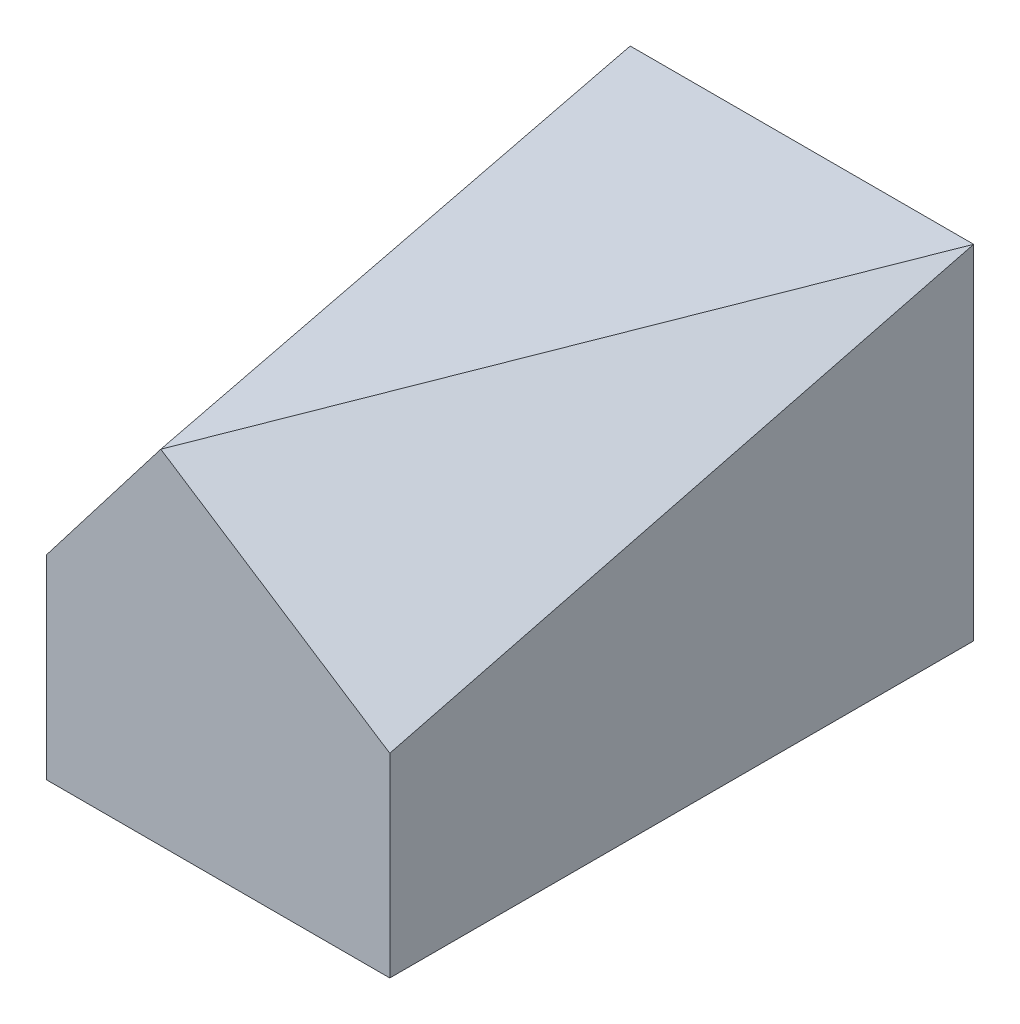
ISO-10303-21;
HEADER;
FILE_DESCRIPTION(('STEP AP214'),'2;1');
FILE_NAME('part.step','',(''),(''),'','','');
FILE_SCHEMA(('AUTOMOTIVE_DESIGN { 1 0 10303 214 1 1 1 1 }'));
ENDSEC;
DATA;
#1=APPLICATION_CONTEXT('core data for automotive mechanical design processes');
#2=APPLICATION_PROTOCOL_DEFINITION('international standard','automotive_design',2000,#1);
#3=PRODUCT_CONTEXT('',#1,'mechanical');
#4=PRODUCT('Part','Part','',(#3));
#5=PRODUCT_RELATED_PRODUCT_CATEGORY('part','',(#4));
#6=PRODUCT_DEFINITION_FORMATION('','',#4);
#7=PRODUCT_DEFINITION_CONTEXT('part definition',#1,'design');
#8=PRODUCT_DEFINITION('design','',#6,#7);
#9=PRODUCT_DEFINITION_SHAPE('','',#8);
#10=(LENGTH_UNIT() NAMED_UNIT(*) SI_UNIT(.MILLI.,.METRE.));
#11=(NAMED_UNIT(*) PLANE_ANGLE_UNIT() SI_UNIT($,.RADIAN.));
#12=(NAMED_UNIT(*) SI_UNIT($,.STERADIAN.) SOLID_ANGLE_UNIT());
#13=UNCERTAINTY_MEASURE_WITH_UNIT(LENGTH_MEASURE(1.E-05),#10,'distance_accuracy_value','');
#14=(GEOMETRIC_REPRESENTATION_CONTEXT(3) GLOBAL_UNCERTAINTY_ASSIGNED_CONTEXT((#13)) GLOBAL_UNIT_ASSIGNED_CONTEXT((#10,
#11,#12)) REPRESENTATION_CONTEXT('',''));
#15=CARTESIAN_POINT('',(0.,0.,0.));
#16=DIRECTION('',(0.,0.,1.));
#17=DIRECTION('',(1.,0.,0.));
#18=AXIS2_PLACEMENT_3D('',#15,#16,#17);
#19=CARTESIAN_POINT('',(30.,30.,0.));
#20=DIRECTION('',(0.,0.,-1.));
#21=DIRECTION('',(-1.,0.,0.));
#22=AXIS2_PLACEMENT_3D('',#19,#20,#21);
#23=PLANE('',#22);
#24=DIRECTION('',(0.838443616300637,-0.544988350595414,0.));
#25=VECTOR('',#24,1.);
#26=CARTESIAN_POINT('',(24.0597539543058,20.8611599297012,0.));
#27=LINE('',#26,#25);
#28=CARTESIAN_POINT('',(10.,30.,0.));
#29=VERTEX_POINT('',#28);
#30=CARTESIAN_POINT('',(30.,17.,0.));
#31=VERTEX_POINT('',#30);
#32=EDGE_CURVE('E100',#29,#31,#27,.T.);
#33=ORIENTED_EDGE('',*,*,#32,.F.);
#34=DIRECTION('',(-0.609710760849693,-0.7926239891046,0.));
#35=VECTOR('',#34,1.);
#36=CARTESIAN_POINT('',(17.4349442379182,39.6654275092937,0.));
#37=LINE('',#36,#35);
#38=CARTESIAN_POINT('',(0.,17.,0.));
#39=VERTEX_POINT('',#38);
#40=EDGE_CURVE('E83',#29,#39,#37,.T.);
#41=ORIENTED_EDGE('',*,*,#40,.T.);
#42=DIRECTION('',(0.,-1.,0.));
#43=VECTOR('',#42,1.);
#44=CARTESIAN_POINT('',(0.,30.,0.));
#45=LINE('',#44,#43);
#46=CARTESIAN_POINT('',(0.,0.,0.));
#47=VERTEX_POINT('',#46);
#48=EDGE_CURVE('E77',#39,#47,#45,.T.);
#49=ORIENTED_EDGE('',*,*,#48,.T.);
#50=DIRECTION('',(1.,0.,0.));
#51=VECTOR('',#50,1.);
#52=CARTESIAN_POINT('',(30.,0.,0.));
#53=LINE('',#52,#51);
#54=CARTESIAN_POINT('',(30.,0.,0.));
#55=VERTEX_POINT('',#54);
#56=EDGE_CURVE('E81',#47,#55,#53,.T.);
#57=ORIENTED_EDGE('',*,*,#56,.T.);
#58=DIRECTION('',(0.,-1.,0.));
#59=VECTOR('',#58,1.);
#60=CARTESIAN_POINT('',(30.,30.,0.));
#61=LINE('',#60,#59);
#62=EDGE_CURVE('E112',#31,#55,#61,.T.);
#63=ORIENTED_EDGE('',*,*,#62,.F.);
#64=EDGE_LOOP('',(#33,#41,#49,#57,#63));
#65=FACE_BOUND('',#64,.T.);
#66=ADVANCED_FACE('F35',(#65),#23,.F.);
#67=CARTESIAN_POINT('',(30.,30.,-51.));
#68=DIRECTION('',(-1.,0.,0.));
#69=DIRECTION('',(0.,0.,1.));
#70=AXIS2_PLACEMENT_3D('',#67,#68,#69);
#71=PLANE('',#70);
#72=DIRECTION('',(0.,0.247003705083364,-0.969014535327046));
#73=VECTOR('',#72,1.);
#74=CARTESIAN_POINT('',(30.,30.,-51.));
#75=LINE('',#74,#73);
#76=CARTESIAN_POINT('',(30.,30.,-51.));
#77=VERTEX_POINT('',#76);
#78=EDGE_CURVE('E49',#31,#77,#75,.T.);
#79=ORIENTED_EDGE('',*,*,#78,.F.);
#80=ORIENTED_EDGE('',*,*,#62,.T.);
#81=DIRECTION('',(0.,0.,-1.));
#82=VECTOR('',#81,1.);
#83=CARTESIAN_POINT('',(30.,0.,-51.));
#84=LINE('',#83,#82);
#85=CARTESIAN_POINT('',(30.,0.,-51.));
#86=VERTEX_POINT('',#85);
#87=EDGE_CURVE('E99',#55,#86,#84,.T.);
#88=ORIENTED_EDGE('',*,*,#87,.T.);
#89=DIRECTION('',(0.,-1.,0.));
#90=VECTOR('',#89,1.);
#91=CARTESIAN_POINT('',(30.,30.,-51.));
#92=LINE('',#91,#90);
#93=EDGE_CURVE('E109',#77,#86,#92,.T.);
#94=ORIENTED_EDGE('',*,*,#93,.F.);
#95=EDGE_LOOP('',(#79,#80,#88,#94));
#96=FACE_BOUND('',#95,.T.);
#97=ADVANCED_FACE('F120',(#96),#71,.F.);
#98=CARTESIAN_POINT('',(0.,30.,0.));
#99=DIRECTION('',(0.,-1.,0.));
#100=DIRECTION('',(0.,0.,-1.));
#101=AXIS2_PLACEMENT_3D('',#98,#99,#100);
#102=PLANE('',#101);
#103=DIRECTION('',(-1.,0.,0.));
#104=VECTOR('',#103,1.);
#105=CARTESIAN_POINT('',(0.,30.,-51.));
#106=LINE('',#105,#104);
#107=CARTESIAN_POINT('',(0.,30.,-51.));
#108=VERTEX_POINT('',#107);
#109=EDGE_CURVE('E86',#77,#108,#106,.T.);
#110=ORIENTED_EDGE('',*,*,#109,.T.);
#111=DIRECTION('',(0.192414460721011,0.,0.981313749677157));
#112=VECTOR('',#111,1.);
#113=CARTESIAN_POINT('',(9.62976675305443,30.,-1.88818955942244));
#114=LINE('',#113,#112);
#115=EDGE_CURVE('E58',#108,#29,#114,.T.);
#116=ORIENTED_EDGE('',*,*,#115,.T.);
#117=DIRECTION('',(-0.365087528818456,0.,0.930973198487063));
#118=VECTOR('',#117,1.);
#119=CARTESIAN_POINT('',(8.66711096301233,30.,3.39886704431856));
#120=LINE('',#119,#118);
#121=EDGE_CURVE('E42',#77,#29,#120,.T.);
#122=ORIENTED_EDGE('',*,*,#121,.F.);
#123=EDGE_LOOP('',(#110,#116,#122));
#124=FACE_BOUND('',#123,.T.);
#125=ADVANCED_FACE('F118',(#124),#102,.F.);
#126=CARTESIAN_POINT('',(0.,30.,-51.));
#127=DIRECTION('',(0.,0.,1.));
#128=DIRECTION('',(1.,0.,0.));
#129=AXIS2_PLACEMENT_3D('',#126,#127,#128);
#130=PLANE('',#129);
#131=DIRECTION('',(-1.,0.,0.));
#132=VECTOR('',#131,1.);
#133=CARTESIAN_POINT('',(0.,0.,-51.));
#134=LINE('',#133,#132);
#135=CARTESIAN_POINT('',(0.,0.,-51.));
#136=VERTEX_POINT('',#135);
#137=EDGE_CURVE('E95',#86,#136,#134,.T.);
#138=ORIENTED_EDGE('',*,*,#137,.T.);
#139=DIRECTION('',(0.,-1.,0.));
#140=VECTOR('',#139,1.);
#141=CARTESIAN_POINT('',(0.,30.,-51.));
#142=LINE('',#141,#140);
#143=EDGE_CURVE('E85',#108,#136,#142,.T.);
#144=ORIENTED_EDGE('',*,*,#143,.F.);
#145=ORIENTED_EDGE('',*,*,#109,.F.);
#146=ORIENTED_EDGE('',*,*,#93,.T.);
#147=EDGE_LOOP('',(#138,#144,#145,#146));
#148=FACE_BOUND('',#147,.T.);
#149=ADVANCED_FACE('F122',(#148),#130,.F.);
#150=CARTESIAN_POINT('',(0.,30.,0.));
#151=DIRECTION('',(1.,0.,0.));
#152=DIRECTION('',(0.,0.,-1.));
#153=AXIS2_PLACEMENT_3D('',#150,#151,#152);
#154=PLANE('',#153);
#155=ORIENTED_EDGE('',*,*,#48,.F.);
#156=DIRECTION('',(0.,0.247003705083365,-0.969014535327046));
#157=VECTOR('',#156,1.);
#158=CARTESIAN_POINT('',(0.,17.7931407942238,-3.1115523465704));
#159=LINE('',#158,#157);
#160=EDGE_CURVE('E12',#39,#108,#159,.T.);
#161=ORIENTED_EDGE('',*,*,#160,.T.);
#162=ORIENTED_EDGE('',*,*,#143,.T.);
#163=DIRECTION('',(0.,0.,1.));
#164=VECTOR('',#163,1.);
#165=CARTESIAN_POINT('',(0.,0.,0.));
#166=LINE('',#165,#164);
#167=EDGE_CURVE('E90',#136,#47,#166,.T.);
#168=ORIENTED_EDGE('',*,*,#167,.T.);
#169=EDGE_LOOP('',(#155,#161,#162,#168));
#170=FACE_BOUND('',#169,.T.);
#171=ADVANCED_FACE('F91',(#170),#154,.F.);
#172=CARTESIAN_POINT('',(0.,0.,0.));
#173=DIRECTION('',(0.,-1.,0.));
#174=DIRECTION('',(0.,0.,-1.));
#175=AXIS2_PLACEMENT_3D('',#172,#173,#174);
#176=PLANE('',#175);
#177=ORIENTED_EDGE('',*,*,#56,.F.);
#178=ORIENTED_EDGE('',*,*,#167,.F.);
#179=ORIENTED_EDGE('',*,*,#137,.F.);
#180=ORIENTED_EDGE('',*,*,#87,.F.);
#181=EDGE_LOOP('',(#177,#178,#179,#180));
#182=FACE_BOUND('',#181,.T.);
#183=ADVANCED_FACE('F98',(#182),#176,.T.);
#184=CARTESIAN_POINT('',(15.9498477935394,24.538227374676,6.25484227197624));
#185=DIRECTION('',(0.532952516988522,0.819926949213111,0.209000987054322));
#186=DIRECTION('',(-0.838443616300637,0.544988350595414,0.));
#187=AXIS2_PLACEMENT_3D('',#184,#185,#186);
#188=PLANE('',#187);
#189=ORIENTED_EDGE('',*,*,#121,.T.);
#190=ORIENTED_EDGE('',*,*,#32,.T.);
#191=ORIENTED_EDGE('',*,*,#78,.T.);
#192=EDGE_LOOP('',(#189,#190,#191));
#193=FACE_BOUND('',#192,.T.);
#194=ADVANCED_FACE('F115',(#193),#188,.T.);
#195=CARTESIAN_POINT('',(-8.02185134997467,6.1706548845959,1.5729120294068));
#196=DIRECTION('',(0.783221355345123,-0.602477965650095,-0.153572814773554));
#197=DIRECTION('',(0.609710760849693,0.7926239891046,0.));
#198=AXIS2_PLACEMENT_3D('',#195,#196,#197);
#199=PLANE('',#198);
#200=ORIENTED_EDGE('',*,*,#40,.F.);
#201=ORIENTED_EDGE('',*,*,#115,.F.);
#202=ORIENTED_EDGE('',*,*,#160,.F.);
#203=EDGE_LOOP('',(#200,#201,#202));
#204=FACE_BOUND('',#203,.T.);
#205=ADVANCED_FACE('F165',(#204),#199,.F.);
#206=CLOSED_SHELL('',(#66,#97,#125,#149,#171,#183,#194,#205));
#207=MANIFOLD_SOLID_BREP('B2',#206);
#208=ADVANCED_BREP_SHAPE_REPRESENTATION('',(#18,#207),#14);
#209=SHAPE_DEFINITION_REPRESENTATION(#9,#208);
ENDSEC;
END-ISO-10303-21;
